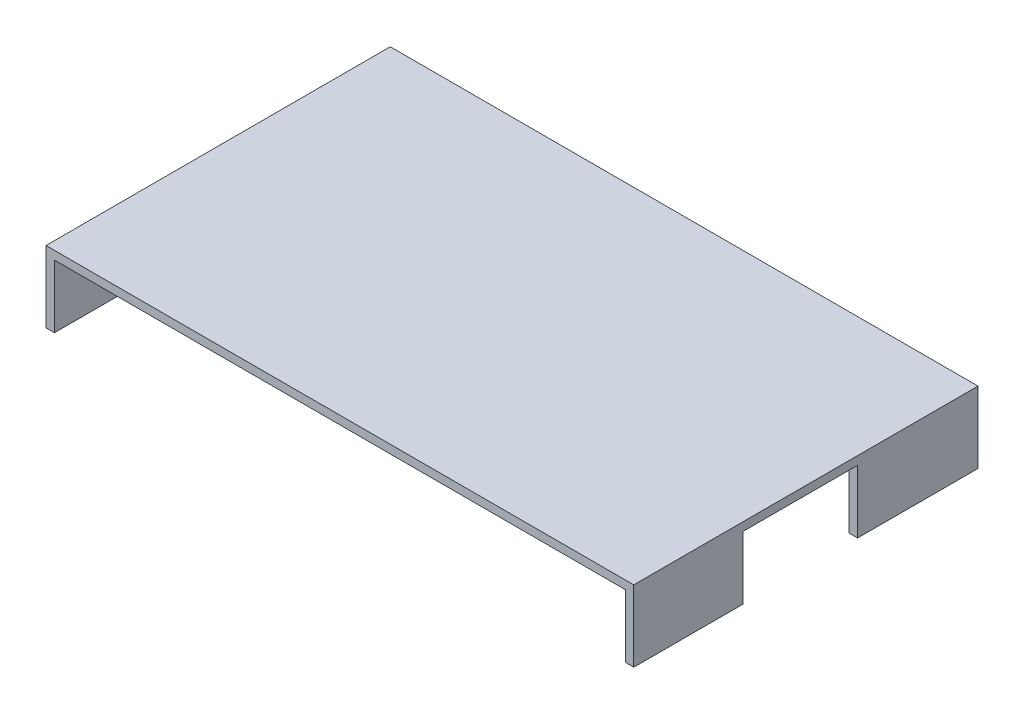
ISO-10303-21;
HEADER;
FILE_DESCRIPTION(('STEP AP214'),'2;1');
FILE_NAME('part.step','',(''),(''),'','','');
FILE_SCHEMA(('AUTOMOTIVE_DESIGN { 1 0 10303 214 1 1 1 1 }'));
ENDSEC;
DATA;
#1=APPLICATION_CONTEXT('core data for automotive mechanical design processes');
#2=APPLICATION_PROTOCOL_DEFINITION('international standard','automotive_design',2000,#1);
#3=PRODUCT_CONTEXT('',#1,'mechanical');
#4=PRODUCT('Part','Part','',(#3));
#5=PRODUCT_RELATED_PRODUCT_CATEGORY('part','',(#4));
#6=PRODUCT_DEFINITION_FORMATION('','',#4);
#7=PRODUCT_DEFINITION_CONTEXT('part definition',#1,'design');
#8=PRODUCT_DEFINITION('design','',#6,#7);
#9=PRODUCT_DEFINITION_SHAPE('','',#8);
#10=(LENGTH_UNIT() NAMED_UNIT(*) SI_UNIT(.MILLI.,.METRE.));
#11=(NAMED_UNIT(*) PLANE_ANGLE_UNIT() SI_UNIT($,.RADIAN.));
#12=(NAMED_UNIT(*) SI_UNIT($,.STERADIAN.) SOLID_ANGLE_UNIT());
#13=UNCERTAINTY_MEASURE_WITH_UNIT(LENGTH_MEASURE(1.E-05),#10,'distance_accuracy_value','');
#14=(GEOMETRIC_REPRESENTATION_CONTEXT(3) GLOBAL_UNCERTAINTY_ASSIGNED_CONTEXT((#13)) GLOBAL_UNIT_ASSIGNED_CONTEXT((#10,
#11,#12)) REPRESENTATION_CONTEXT('',''));
#15=CARTESIAN_POINT('',(0.,0.,0.));
#16=DIRECTION('',(0.,0.,1.));
#17=DIRECTION('',(1.,0.,0.));
#18=AXIS2_PLACEMENT_3D('',#15,#16,#17);
#19=CARTESIAN_POINT('',(68.,-15.,-41.));
#20=DIRECTION('',(1.,0.,0.));
#21=DIRECTION('',(0.,0.,-1.));
#22=AXIS2_PLACEMENT_3D('',#19,#20,#21);
#23=PLANE('',#22);
#24=DIRECTION('',(0.,0.,-1.));
#25=VECTOR('',#24,1.);
#26=CARTESIAN_POINT('',(68.,0.,-41.));
#27=LINE('',#26,#25);
#28=CARTESIAN_POINT('',(68.,0.,41.));
#29=VERTEX_POINT('',#28);
#30=CARTESIAN_POINT('',(68.,0.,14.99));
#31=VERTEX_POINT('',#30);
#32=EDGE_CURVE('E150',#29,#31,#27,.T.);
#33=ORIENTED_EDGE('',*,*,#32,.T.);
#34=DIRECTION('',(0.,-1.,0.));
#35=VECTOR('',#34,1.);
#36=CARTESIAN_POINT('',(68.,-15.,14.99));
#37=LINE('',#36,#35);
#38=CARTESIAN_POINT('',(68.,-15.,14.99));
#39=VERTEX_POINT('',#38);
#40=EDGE_CURVE('E152',#31,#39,#37,.T.);
#41=ORIENTED_EDGE('',*,*,#40,.T.);
#42=DIRECTION('',(0.,0.,-1.));
#43=VECTOR('',#42,1.);
#44=CARTESIAN_POINT('',(68.,-15.,-41.));
#45=LINE('',#44,#43);
#46=CARTESIAN_POINT('',(68.,-15.,41.));
#47=VERTEX_POINT('',#46);
#48=EDGE_CURVE('E155',#47,#39,#45,.T.);
#49=ORIENTED_EDGE('',*,*,#48,.F.);
#50=DIRECTION('',(0.,1.,0.));
#51=VECTOR('',#50,1.);
#52=CARTESIAN_POINT('',(68.,-15.,41.));
#53=LINE('',#52,#51);
#54=EDGE_CURVE('E163',#47,#29,#53,.T.);
#55=ORIENTED_EDGE('',*,*,#54,.T.);
#56=EDGE_LOOP('',(#33,#41,#49,#55));
#57=FACE_BOUND('',#56,.T.);
#58=ADVANCED_FACE('F35',(#57),#23,.F.);
#59=CARTESIAN_POINT('',(0.,-15.,0.));
#60=DIRECTION('',(0.,1.,0.));
#61=DIRECTION('',(0.,0.,1.));
#62=AXIS2_PLACEMENT_3D('',#59,#60,#61);
#63=PLANE('',#62);
#64=ORIENTED_EDGE('',*,*,#48,.T.);
#65=DIRECTION('',(1.,0.,0.));
#66=VECTOR('',#65,1.);
#67=CARTESIAN_POINT('',(0.,-15.,14.99));
#68=LINE('',#67,#66);
#69=CARTESIAN_POINT('',(70.,-15.,14.99));
#70=VERTEX_POINT('',#69);
#71=EDGE_CURVE('E11',#39,#70,#68,.T.);
#72=ORIENTED_EDGE('',*,*,#71,.T.);
#73=DIRECTION('',(0.,0.,1.));
#74=VECTOR('',#73,1.);
#75=CARTESIAN_POINT('',(70.,-15.,41.));
#76=LINE('',#75,#74);
#77=CARTESIAN_POINT('',(70.,-15.,41.));
#78=VERTEX_POINT('',#77);
#79=EDGE_CURVE('E146',#70,#78,#76,.T.);
#80=ORIENTED_EDGE('',*,*,#79,.T.);
#81=DIRECTION('',(-1.,0.,0.));
#82=VECTOR('',#81,1.);
#83=CARTESIAN_POINT('',(68.,-15.,41.));
#84=LINE('',#83,#82);
#85=EDGE_CURVE('E145',#78,#47,#84,.T.);
#86=ORIENTED_EDGE('',*,*,#85,.T.);
#87=EDGE_LOOP('',(#64,#72,#80,#86));
#88=FACE_BOUND('',#87,.T.);
#89=ADVANCED_FACE('F258',(#88),#63,.F.);
#90=CARTESIAN_POINT('',(0.,0.,0.));
#91=DIRECTION('',(0.,-1.,0.));
#92=DIRECTION('',(0.,0.,-1.));
#93=AXIS2_PLACEMENT_3D('',#90,#91,#92);
#94=PLANE('',#93);
#95=CARTESIAN_POINT('',(68.,0.,-12.32));
#96=VERTEX_POINT('',#95);
#97=CARTESIAN_POINT('',(68.,0.,-41.));
#98=VERTEX_POINT('',#97);
#99=EDGE_CURVE('E57',#96,#98,#27,.T.);
#100=ORIENTED_EDGE('',*,*,#99,.F.);
#101=DIRECTION('',(1.,0.,0.));
#102=VECTOR('',#101,1.);
#103=CARTESIAN_POINT('',(50.,0.,-12.32));
#104=LINE('',#103,#102);
#105=CARTESIAN_POINT('',(70.,0.,-12.32));
#106=VERTEX_POINT('',#105);
#107=EDGE_CURVE('E275',#96,#106,#104,.T.);
#108=ORIENTED_EDGE('',*,*,#107,.T.);
#109=DIRECTION('',(0.,0.,1.));
#110=VECTOR('',#109,1.);
#111=CARTESIAN_POINT('',(70.,0.,0.));
#112=LINE('',#111,#110);
#113=CARTESIAN_POINT('',(70.,0.,14.99));
#114=VERTEX_POINT('',#113);
#115=EDGE_CURVE('E139',#106,#114,#112,.T.);
#116=ORIENTED_EDGE('',*,*,#115,.T.);
#117=DIRECTION('',(1.,0.,0.));
#118=VECTOR('',#117,1.);
#119=CARTESIAN_POINT('',(50.,0.,14.99));
#120=LINE('',#119,#118);
#121=EDGE_CURVE('E274',#31,#114,#120,.T.);
#122=ORIENTED_EDGE('',*,*,#121,.F.);
#123=ORIENTED_EDGE('',*,*,#32,.F.);
#124=DIRECTION('',(1.,0.,0.));
#125=VECTOR('',#124,1.);
#126=CARTESIAN_POINT('',(0.,0.,41.));
#127=LINE('',#126,#125);
#128=CARTESIAN_POINT('',(-68.,0.,41.));
#129=VERTEX_POINT('',#128);
#130=EDGE_CURVE('E185',#129,#29,#127,.T.);
#131=ORIENTED_EDGE('',*,*,#130,.F.);
#132=DIRECTION('',(0.,0.,1.));
#133=VECTOR('',#132,1.);
#134=CARTESIAN_POINT('',(-68.,0.,-41.));
#135=LINE('',#134,#133);
#136=CARTESIAN_POINT('',(-68.,0.,-41.));
#137=VERTEX_POINT('',#136);
#138=EDGE_CURVE('E165',#137,#129,#135,.T.);
#139=ORIENTED_EDGE('',*,*,#138,.F.);
#140=DIRECTION('',(-1.,0.,0.));
#141=VECTOR('',#140,1.);
#142=CARTESIAN_POINT('',(0.,0.,-41.));
#143=LINE('',#142,#141);
#144=EDGE_CURVE('E195',#98,#137,#143,.T.);
#145=ORIENTED_EDGE('',*,*,#144,.F.);
#146=EDGE_LOOP('',(#100,#108,#116,#122,#123,#131,#139,#145));
#147=FACE_BOUND('',#146,.T.);
#148=ADVANCED_FACE('F241',(#147),#94,.T.);
#149=CARTESIAN_POINT('',(0.,2.,-41.));
#150=DIRECTION('',(0.,0.,1.));
#151=DIRECTION('',(1.,0.,0.));
#152=AXIS2_PLACEMENT_3D('',#149,#150,#151);
#153=PLANE('',#152);
#154=DIRECTION('',(0.,-1.,0.));
#155=VECTOR('',#154,1.);
#156=CARTESIAN_POINT('',(70.,2.,-41.));
#157=LINE('',#156,#155);
#158=CARTESIAN_POINT('',(70.,2.,-41.));
#159=VERTEX_POINT('',#158);
#160=CARTESIAN_POINT('',(70.,-15.,-41.));
#161=VERTEX_POINT('',#160);
#162=EDGE_CURVE('E205',#159,#161,#157,.T.);
#163=ORIENTED_EDGE('',*,*,#162,.T.);
#164=DIRECTION('',(1.,0.,0.));
#165=VECTOR('',#164,1.);
#166=CARTESIAN_POINT('',(70.,-15.,-41.));
#167=LINE('',#166,#165);
#168=CARTESIAN_POINT('',(68.,-15.,-41.));
#169=VERTEX_POINT('',#168);
#170=EDGE_CURVE('E144',#169,#161,#167,.T.);
#171=ORIENTED_EDGE('',*,*,#170,.F.);
#172=DIRECTION('',(0.,1.,0.));
#173=VECTOR('',#172,1.);
#174=CARTESIAN_POINT('',(68.,-15.,-41.));
#175=LINE('',#174,#173);
#176=EDGE_CURVE('E159',#169,#98,#175,.T.);
#177=ORIENTED_EDGE('',*,*,#176,.T.);
#178=ORIENTED_EDGE('',*,*,#144,.T.);
#179=DIRECTION('',(0.,1.,0.));
#180=VECTOR('',#179,1.);
#181=CARTESIAN_POINT('',(-68.,-15.,-41.));
#182=LINE('',#181,#180);
#183=CARTESIAN_POINT('',(-68.,-15.,-41.));
#184=VERTEX_POINT('',#183);
#185=EDGE_CURVE('E190',#184,#137,#182,.T.);
#186=ORIENTED_EDGE('',*,*,#185,.F.);
#187=DIRECTION('',(1.,0.,0.));
#188=VECTOR('',#187,1.);
#189=CARTESIAN_POINT('',(-70.,-15.,-41.));
#190=LINE('',#189,#188);
#191=CARTESIAN_POINT('',(-70.,-15.,-41.));
#192=VERTEX_POINT('',#191);
#193=EDGE_CURVE('E169',#192,#184,#190,.T.);
#194=ORIENTED_EDGE('',*,*,#193,.F.);
#195=DIRECTION('',(0.,-1.,0.));
#196=VECTOR('',#195,1.);
#197=CARTESIAN_POINT('',(-70.,2.,-41.));
#198=LINE('',#197,#196);
#199=CARTESIAN_POINT('',(-70.,2.,-41.));
#200=VERTEX_POINT('',#199);
#201=EDGE_CURVE('E130',#200,#192,#198,.T.);
#202=ORIENTED_EDGE('',*,*,#201,.F.);
#203=DIRECTION('',(-1.,0.,0.));
#204=VECTOR('',#203,1.);
#205=CARTESIAN_POINT('',(0.,2.,-41.));
#206=LINE('',#205,#204);
#207=EDGE_CURVE('E179',#159,#200,#206,.T.);
#208=ORIENTED_EDGE('',*,*,#207,.F.);
#209=EDGE_LOOP('',(#163,#171,#177,#178,#186,#194,#202,#208));
#210=FACE_BOUND('',#209,.T.);
#211=ADVANCED_FACE('F37',(#210),#153,.F.);
#212=CARTESIAN_POINT('',(-70.,2.,41.));
#213=DIRECTION('',(1.,0.,0.));
#214=DIRECTION('',(0.,0.,-1.));
#215=AXIS2_PLACEMENT_3D('',#212,#213,#214);
#216=PLANE('',#215);
#217=ORIENTED_EDGE('',*,*,#201,.T.);
#218=DIRECTION('',(0.,0.,-1.));
#219=VECTOR('',#218,1.);
#220=CARTESIAN_POINT('',(-70.,-15.,41.));
#221=LINE('',#220,#219);
#222=CARTESIAN_POINT('',(-70.,-15.,41.));
#223=VERTEX_POINT('',#222);
#224=EDGE_CURVE('E166',#223,#192,#221,.T.);
#225=ORIENTED_EDGE('',*,*,#224,.F.);
#226=DIRECTION('',(0.,-1.,0.));
#227=VECTOR('',#226,1.);
#228=CARTESIAN_POINT('',(-70.,2.,41.));
#229=LINE('',#228,#227);
#230=CARTESIAN_POINT('',(-70.,2.,41.));
#231=VERTEX_POINT('',#230);
#232=EDGE_CURVE('E210',#231,#223,#229,.T.);
#233=ORIENTED_EDGE('',*,*,#232,.F.);
#234=DIRECTION('',(0.,0.,1.));
#235=VECTOR('',#234,1.);
#236=CARTESIAN_POINT('',(-70.,2.,-41.));
#237=LINE('',#236,#235);
#238=EDGE_CURVE('E218',#200,#231,#237,.T.);
#239=ORIENTED_EDGE('',*,*,#238,.F.);
#240=EDGE_LOOP('',(#217,#225,#233,#239));
#241=FACE_BOUND('',#240,.T.);
#242=ADVANCED_FACE('F216',(#241),#216,.F.);
#243=CARTESIAN_POINT('',(0.,2.,41.));
#244=DIRECTION('',(0.,0.,-1.));
#245=DIRECTION('',(-1.,0.,0.));
#246=AXIS2_PLACEMENT_3D('',#243,#244,#245);
#247=PLANE('',#246);
#248=ORIENTED_EDGE('',*,*,#232,.T.);
#249=DIRECTION('',(-1.,0.,0.));
#250=VECTOR('',#249,1.);
#251=CARTESIAN_POINT('',(-68.,-15.,41.));
#252=LINE('',#251,#250);
#253=CARTESIAN_POINT('',(-68.,-15.,41.));
#254=VERTEX_POINT('',#253);
#255=EDGE_CURVE('E173',#254,#223,#252,.T.);
#256=ORIENTED_EDGE('',*,*,#255,.F.);
#257=DIRECTION('',(0.,1.,0.));
#258=VECTOR('',#257,1.);
#259=CARTESIAN_POINT('',(-68.,-15.,41.));
#260=LINE('',#259,#258);
#261=EDGE_CURVE('E176',#254,#129,#260,.T.);
#262=ORIENTED_EDGE('',*,*,#261,.T.);
#263=ORIENTED_EDGE('',*,*,#130,.T.);
#264=ORIENTED_EDGE('',*,*,#54,.F.);
#265=ORIENTED_EDGE('',*,*,#85,.F.);
#266=DIRECTION('',(0.,-1.,0.));
#267=VECTOR('',#266,1.);
#268=CARTESIAN_POINT('',(70.,2.,41.));
#269=LINE('',#268,#267);
#270=CARTESIAN_POINT('',(70.,2.,41.));
#271=VERTEX_POINT('',#270);
#272=EDGE_CURVE('E207',#271,#78,#269,.T.);
#273=ORIENTED_EDGE('',*,*,#272,.F.);
#274=DIRECTION('',(1.,0.,0.));
#275=VECTOR('',#274,1.);
#276=CARTESIAN_POINT('',(0.,2.,41.));
#277=LINE('',#276,#275);
#278=EDGE_CURVE('E232',#231,#271,#277,.T.);
#279=ORIENTED_EDGE('',*,*,#278,.F.);
#280=EDGE_LOOP('',(#248,#256,#262,#263,#264,#265,#273,#279));
#281=FACE_BOUND('',#280,.T.);
#282=ADVANCED_FACE('F228',(#281),#247,.F.);
#283=CARTESIAN_POINT('',(70.,2.,-41.));
#284=DIRECTION('',(-1.,0.,0.));
#285=DIRECTION('',(0.,0.,1.));
#286=AXIS2_PLACEMENT_3D('',#283,#284,#285);
#287=PLANE('',#286);
#288=ORIENTED_EDGE('',*,*,#79,.F.);
#289=DIRECTION('',(0.,-1.,0.));
#290=VECTOR('',#289,1.);
#291=CARTESIAN_POINT('',(70.,0.,14.99));
#292=LINE('',#291,#290);
#293=EDGE_CURVE('E273',#114,#70,#292,.T.);
#294=ORIENTED_EDGE('',*,*,#293,.F.);
#295=ORIENTED_EDGE('',*,*,#115,.F.);
#296=DIRECTION('',(0.,1.,0.));
#297=VECTOR('',#296,1.);
#298=CARTESIAN_POINT('',(70.,0.,-12.32));
#299=LINE('',#298,#297);
#300=CARTESIAN_POINT('',(70.,-15.,-12.32));
#301=VERTEX_POINT('',#300);
#302=EDGE_CURVE('E125',#301,#106,#299,.T.);
#303=ORIENTED_EDGE('',*,*,#302,.F.);
#304=EDGE_CURVE('E136',#161,#301,#76,.T.);
#305=ORIENTED_EDGE('',*,*,#304,.F.);
#306=ORIENTED_EDGE('',*,*,#162,.F.);
#307=DIRECTION('',(0.,0.,-1.));
#308=VECTOR('',#307,1.);
#309=CARTESIAN_POINT('',(70.,2.,41.));
#310=LINE('',#309,#308);
#311=EDGE_CURVE('E201',#271,#159,#310,.T.);
#312=ORIENTED_EDGE('',*,*,#311,.F.);
#313=ORIENTED_EDGE('',*,*,#272,.T.);
#314=EDGE_LOOP('',(#288,#294,#295,#303,#305,#306,#312,#313));
#315=FACE_BOUND('',#314,.T.);
#316=ADVANCED_FACE('F134',(#315),#287,.F.);
#317=CARTESIAN_POINT('',(0.,2.,0.));
#318=DIRECTION('',(0.,-1.,0.));
#319=DIRECTION('',(0.,0.,-1.));
#320=AXIS2_PLACEMENT_3D('',#317,#318,#319);
#321=PLANE('',#320);
#322=ORIENTED_EDGE('',*,*,#207,.T.);
#323=ORIENTED_EDGE('',*,*,#238,.T.);
#324=ORIENTED_EDGE('',*,*,#278,.T.);
#325=ORIENTED_EDGE('',*,*,#311,.T.);
#326=EDGE_LOOP('',(#322,#323,#324,#325));
#327=FACE_BOUND('',#326,.T.);
#328=ADVANCED_FACE('F247',(#327),#321,.F.);
#329=CARTESIAN_POINT('',(-68.,-15.,-41.));
#330=DIRECTION('',(-1.,0.,0.));
#331=DIRECTION('',(0.,0.,1.));
#332=AXIS2_PLACEMENT_3D('',#329,#330,#331);
#333=PLANE('',#332);
#334=ORIENTED_EDGE('',*,*,#138,.T.);
#335=ORIENTED_EDGE('',*,*,#261,.F.);
#336=DIRECTION('',(0.,0.,1.));
#337=VECTOR('',#336,1.);
#338=CARTESIAN_POINT('',(-68.,-15.,-41.));
#339=LINE('',#338,#337);
#340=EDGE_CURVE('E171',#184,#254,#339,.T.);
#341=ORIENTED_EDGE('',*,*,#340,.F.);
#342=ORIENTED_EDGE('',*,*,#185,.T.);
#343=EDGE_LOOP('',(#334,#335,#341,#342));
#344=FACE_BOUND('',#343,.T.);
#345=ADVANCED_FACE('F245',(#344),#333,.F.);
#346=CARTESIAN_POINT('',(0.,-15.,0.));
#347=DIRECTION('',(0.,-1.,0.));
#348=DIRECTION('',(0.,0.,-1.));
#349=AXIS2_PLACEMENT_3D('',#346,#347,#348);
#350=PLANE('',#349);
#351=ORIENTED_EDGE('',*,*,#224,.T.);
#352=ORIENTED_EDGE('',*,*,#193,.T.);
#353=ORIENTED_EDGE('',*,*,#340,.T.);
#354=ORIENTED_EDGE('',*,*,#255,.T.);
#355=EDGE_LOOP('',(#351,#352,#353,#354));
#356=FACE_BOUND('',#355,.T.);
#357=ADVANCED_FACE('F224',(#356),#350,.T.);
#358=CARTESIAN_POINT('',(68.,-15.,-12.32));
#359=VERTEX_POINT('',#358);
#360=EDGE_CURVE('E148',#359,#169,#45,.T.);
#361=ORIENTED_EDGE('',*,*,#360,.F.);
#362=DIRECTION('',(0.,1.,0.));
#363=VECTOR('',#362,1.);
#364=CARTESIAN_POINT('',(68.,-15.,-12.32));
#365=LINE('',#364,#363);
#366=EDGE_CURVE('E50',#359,#96,#365,.T.);
#367=ORIENTED_EDGE('',*,*,#366,.T.);
#368=ORIENTED_EDGE('',*,*,#99,.T.);
#369=ORIENTED_EDGE('',*,*,#176,.F.);
#370=EDGE_LOOP('',(#361,#367,#368,#369));
#371=FACE_BOUND('',#370,.T.);
#372=ADVANCED_FACE('F253',(#371),#23,.F.);
#373=ORIENTED_EDGE('',*,*,#304,.T.);
#374=DIRECTION('',(-1.,0.,0.));
#375=VECTOR('',#374,1.);
#376=CARTESIAN_POINT('',(0.,-15.,-12.32));
#377=LINE('',#376,#375);
#378=EDGE_CURVE('E43',#301,#359,#377,.T.);
#379=ORIENTED_EDGE('',*,*,#378,.T.);
#380=ORIENTED_EDGE('',*,*,#360,.T.);
#381=ORIENTED_EDGE('',*,*,#170,.T.);
#382=EDGE_LOOP('',(#373,#379,#380,#381));
#383=FACE_BOUND('',#382,.T.);
#384=ADVANCED_FACE('F142',(#383),#63,.F.);
#385=CARTESIAN_POINT('',(50.,0.,14.99));
#386=DIRECTION('',(0.,0.,1.));
#387=DIRECTION('',(0.,-1.,0.));
#388=AXIS2_PLACEMENT_3D('',#385,#386,#387);
#389=PLANE('',#388);
#390=ORIENTED_EDGE('',*,*,#121,.T.);
#391=ORIENTED_EDGE('',*,*,#293,.T.);
#392=ORIENTED_EDGE('',*,*,#71,.F.);
#393=ORIENTED_EDGE('',*,*,#40,.F.);
#394=EDGE_LOOP('',(#390,#391,#392,#393));
#395=FACE_BOUND('',#394,.T.);
#396=ADVANCED_FACE('F270',(#395),#389,.F.);
#397=CARTESIAN_POINT('',(50.,0.,-12.32));
#398=DIRECTION('',(0.,0.,-1.));
#399=DIRECTION('',(-1.,0.,0.));
#400=AXIS2_PLACEMENT_3D('',#397,#398,#399);
#401=PLANE('',#400);
#402=ORIENTED_EDGE('',*,*,#378,.F.);
#403=ORIENTED_EDGE('',*,*,#302,.T.);
#404=ORIENTED_EDGE('',*,*,#107,.F.);
#405=ORIENTED_EDGE('',*,*,#366,.F.);
#406=EDGE_LOOP('',(#402,#403,#404,#405));
#407=FACE_BOUND('',#406,.T.);
#408=ADVANCED_FACE('F124',(#407),#401,.F.);
#409=CLOSED_SHELL('',(#58,#89,#148,#211,#242,#282,#316,#328,#345,#357,#372,#384,#396,#408));
#410=MANIFOLD_SOLID_BREP('B2',#409);
#411=ADVANCED_BREP_SHAPE_REPRESENTATION('',(#18,#410),#14);
#412=SHAPE_DEFINITION_REPRESENTATION(#9,#411);
ENDSEC;
END-ISO-10303-21;
